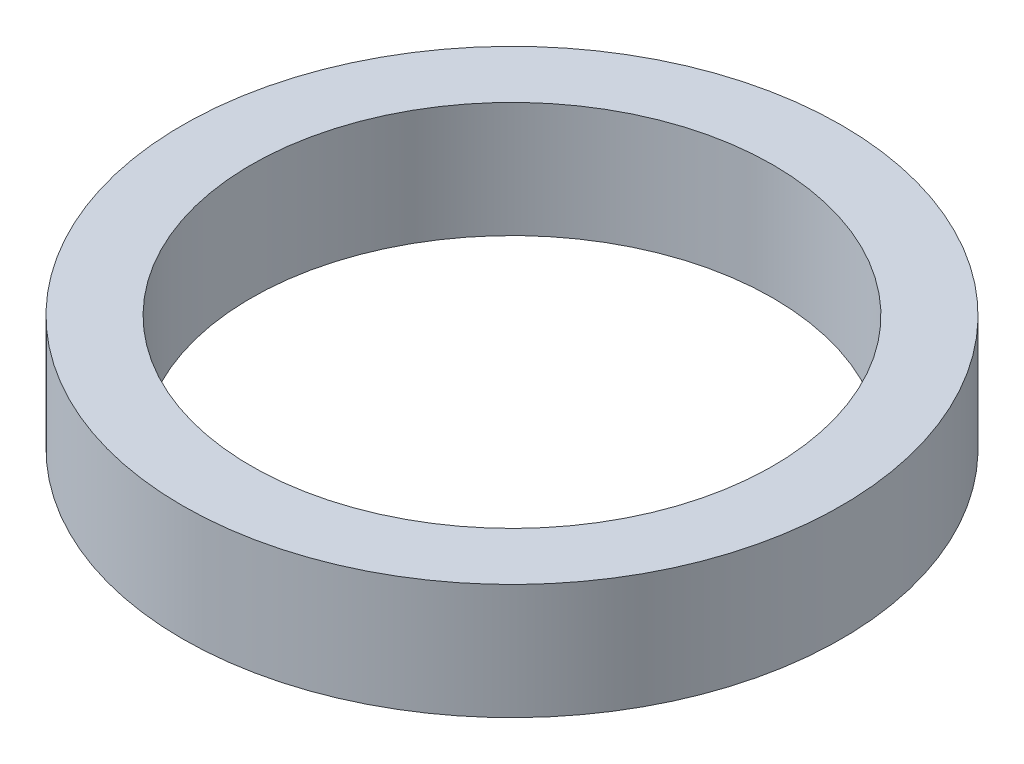
ISO-10303-21;
HEADER;
FILE_DESCRIPTION(('STEP AP214'),'2;1');
FILE_NAME('part.step','',(''),(''),'','','');
FILE_SCHEMA(('AUTOMOTIVE_DESIGN { 1 0 10303 214 1 1 1 1 }'));
ENDSEC;
DATA;
#1=APPLICATION_CONTEXT('core data for automotive mechanical design processes');
#2=APPLICATION_PROTOCOL_DEFINITION('international standard','automotive_design',2000,#1);
#3=PRODUCT_CONTEXT('',#1,'mechanical');
#4=PRODUCT('Part','Part','',(#3));
#5=PRODUCT_RELATED_PRODUCT_CATEGORY('part','',(#4));
#6=PRODUCT_DEFINITION_FORMATION('','',#4);
#7=PRODUCT_DEFINITION_CONTEXT('part definition',#1,'design');
#8=PRODUCT_DEFINITION('design','',#6,#7);
#9=PRODUCT_DEFINITION_SHAPE('','',#8);
#10=(LENGTH_UNIT() NAMED_UNIT(*) SI_UNIT(.MILLI.,.METRE.));
#11=(NAMED_UNIT(*) PLANE_ANGLE_UNIT() SI_UNIT($,.RADIAN.));
#12=(NAMED_UNIT(*) SI_UNIT($,.STERADIAN.) SOLID_ANGLE_UNIT());
#13=UNCERTAINTY_MEASURE_WITH_UNIT(LENGTH_MEASURE(1.E-05),#10,'distance_accuracy_value','');
#14=(GEOMETRIC_REPRESENTATION_CONTEXT(3) GLOBAL_UNCERTAINTY_ASSIGNED_CONTEXT((#13)) GLOBAL_UNIT_ASSIGNED_CONTEXT((#10,
#11,#12)) REPRESENTATION_CONTEXT('',''));
#15=CARTESIAN_POINT('',(0.,0.,0.));
#16=DIRECTION('',(0.,0.,1.));
#17=DIRECTION('',(1.,0.,0.));
#18=AXIS2_PLACEMENT_3D('',#15,#16,#17);
#19=CARTESIAN_POINT('',(0.,21.,0.));
#20=DIRECTION('',(0.,-1.,0.));
#21=DIRECTION('',(0.,0.,-1.));
#22=AXIS2_PLACEMENT_3D('',#19,#20,#21);
#23=CYLINDRICAL_SURFACE('',#22,60.);
#24=CARTESIAN_POINT('',(0.,21.,0.));
#25=DIRECTION('',(0.,1.,0.));
#26=DIRECTION('',(0.,0.,1.));
#27=AXIS2_PLACEMENT_3D('',#24,#25,#26);
#28=CIRCLE('',#27,60.);
#29=CARTESIAN_POINT('',(0.,21.,-60.));
#30=VERTEX_POINT('',#29);
#31=EDGE_CURVE('E10',#30,#30,#28,.T.);
#32=CARTESIAN_POINT('',(0.,0.,0.));
#33=DIRECTION('',(0.,1.,0.));
#34=DIRECTION('',(0.,0.,1.));
#35=AXIS2_PLACEMENT_3D('',#32,#33,#34);
#36=CIRCLE('',#35,60.);
#37=CARTESIAN_POINT('',(0.,0.,-60.));
#38=VERTEX_POINT('',#37);
#39=EDGE_CURVE('E37',#38,#38,#36,.T.);
#40=CARTESIAN_POINT('',(0.,21.,-60.));
#41=CARTESIAN_POINT('',(0.,20.78125,-60.));
#42=CARTESIAN_POINT('',(0.,20.5625,-60.));
#43=CARTESIAN_POINT('',(0.,20.125,-60.));
#44=CARTESIAN_POINT('',(0.,19.90625,-60.));
#45=CARTESIAN_POINT('',(0.,19.46875,-60.));
#46=CARTESIAN_POINT('',(0.,19.25,-60.));
#47=CARTESIAN_POINT('',(0.,18.8125,-60.));
#48=CARTESIAN_POINT('',(0.,18.59375,-60.));
#49=CARTESIAN_POINT('',(0.,18.15625,-60.));
#50=CARTESIAN_POINT('',(0.,17.9375,-60.));
#51=CARTESIAN_POINT('',(0.,17.5,-60.));
#52=CARTESIAN_POINT('',(0.,17.28125,-60.));
#53=CARTESIAN_POINT('',(0.,16.84375,-60.));
#54=CARTESIAN_POINT('',(0.,16.625,-60.));
#55=CARTESIAN_POINT('',(0.,16.1875,-60.));
#56=CARTESIAN_POINT('',(0.,15.96875,-60.));
#57=CARTESIAN_POINT('',(0.,15.53125,-60.));
#58=CARTESIAN_POINT('',(0.,15.3125,-60.));
#59=CARTESIAN_POINT('',(0.,14.875,-60.));
#60=CARTESIAN_POINT('',(0.,14.65625,-60.));
#61=CARTESIAN_POINT('',(0.,14.21875,-60.));
#62=CARTESIAN_POINT('',(0.,14.,-60.));
#63=CARTESIAN_POINT('',(0.,13.5625,-60.));
#64=CARTESIAN_POINT('',(0.,13.34375,-60.));
#65=CARTESIAN_POINT('',(0.,12.90625,-60.));
#66=CARTESIAN_POINT('',(0.,12.6875,-60.));
#67=CARTESIAN_POINT('',(0.,12.25,-60.));
#68=CARTESIAN_POINT('',(0.,12.03125,-60.));
#69=CARTESIAN_POINT('',(0.,11.59375,-60.));
#70=CARTESIAN_POINT('',(0.,11.375,-60.));
#71=CARTESIAN_POINT('',(0.,10.9375,-60.));
#72=CARTESIAN_POINT('',(0.,10.71875,-60.));
#73=CARTESIAN_POINT('',(0.,10.28125,-60.));
#74=CARTESIAN_POINT('',(0.,10.0625,-60.));
#75=CARTESIAN_POINT('',(0.,9.625,-60.));
#76=CARTESIAN_POINT('',(0.,9.40625,-60.));
#77=CARTESIAN_POINT('',(0.,8.96875,-60.));
#78=CARTESIAN_POINT('',(0.,8.75,-60.));
#79=CARTESIAN_POINT('',(0.,8.3125,-60.));
#80=CARTESIAN_POINT('',(0.,8.09375,-60.));
#81=CARTESIAN_POINT('',(0.,7.65625,-60.));
#82=CARTESIAN_POINT('',(0.,7.4375,-60.));
#83=CARTESIAN_POINT('',(0.,7.,-60.));
#84=CARTESIAN_POINT('',(0.,6.78125,-60.));
#85=CARTESIAN_POINT('',(0.,6.34375,-60.));
#86=CARTESIAN_POINT('',(0.,6.125,-60.));
#87=CARTESIAN_POINT('',(0.,5.6875,-60.));
#88=CARTESIAN_POINT('',(0.,5.46875,-60.));
#89=CARTESIAN_POINT('',(0.,5.03125,-60.));
#90=CARTESIAN_POINT('',(0.,4.8125,-60.));
#91=CARTESIAN_POINT('',(0.,4.375,-60.));
#92=CARTESIAN_POINT('',(0.,4.15625,-60.));
#93=CARTESIAN_POINT('',(0.,3.71875,-60.));
#94=CARTESIAN_POINT('',(0.,3.5,-60.));
#95=CARTESIAN_POINT('',(0.,3.0625,-60.));
#96=CARTESIAN_POINT('',(0.,2.84375,-60.));
#97=CARTESIAN_POINT('',(0.,2.40625,-60.));
#98=CARTESIAN_POINT('',(0.,2.1875,-60.));
#99=CARTESIAN_POINT('',(0.,1.75,-60.));
#100=CARTESIAN_POINT('',(0.,1.53125,-60.));
#101=CARTESIAN_POINT('',(0.,1.09375,-60.));
#102=CARTESIAN_POINT('',(0.,0.875000000000001,-60.));
#103=CARTESIAN_POINT('',(0.,0.4375,-60.));
#104=CARTESIAN_POINT('',(0.,0.21875,-60.));
#105=CARTESIAN_POINT('',(0.,0.,-60.));
#106=B_SPLINE_CURVE_WITH_KNOTS('',3,(#40,#41,#42,#43,#44,#45,#46,#47,#48,#49,#50,#51,#52,#53,
#54,#55,#56,#57,#58,#59,#60,#61,#62,#63,#64,#65,#66,#67,#68,#69,#70,#71,#72,#73,#74,#75,#76,#77,
#78,#79,#80,#81,#82,#83,#84,#85,#86,#87,#88,#89,#90,#91,#92,#93,#94,#95,#96,#97,#98,#99,#100,
#101,#102,#103,#104,#105),.UNSPECIFIED.,.F.,.F.,(4,2,2,2,2,2,2,2,2,2,2,2,2,2,2,2,2,2,2,2,2,2,2,
2,2,2,2,2,2,2,2,2,4),(0.,0.656250000000001,1.3125,1.96875,2.625,3.28125,3.9375,4.59375,5.25,
5.90625,6.5625,7.21875,7.875,8.53125,9.1875,9.84375,10.5,11.15625,11.8125,12.46875,13.125,
13.78125,14.4375,15.09375,15.75,16.40625,17.0625,17.71875,18.375,19.03125,19.6875,20.34375,21.),.UNSPECIFIED.);
#107=EDGE_CURVE('BSEAM40',#30,#38,#106,.T.);
#108=ORIENTED_EDGE('',*,*,#31,.F.);
#109=ORIENTED_EDGE('',*,*,#39,.T.);
#110=ORIENTED_EDGE('',*,*,#107,.T.);
#111=ORIENTED_EDGE('',*,*,#107,.F.);
#112=EDGE_LOOP('',(#108,#110,#109,#111));
#113=FACE_BOUND('',#112,.T.);
#114=ADVANCED_FACE('F40',(#113),#23,.T.);
#115=CARTESIAN_POINT('',(0.,21.,0.));
#116=DIRECTION('',(0.,1.,0.));
#117=DIRECTION('',(0.,0.,1.));
#118=AXIS2_PLACEMENT_3D('',#115,#116,#117);
#119=PLANE('',#118);
#120=CARTESIAN_POINT('',(0.,21.,0.));
#121=DIRECTION('',(0.,1.,0.));
#122=DIRECTION('',(0.,0.,1.));
#123=AXIS2_PLACEMENT_3D('',#120,#121,#122);
#124=CIRCLE('',#123,47.5);
#125=CARTESIAN_POINT('',(0.,21.,-47.5));
#126=VERTEX_POINT('',#125);
#127=EDGE_CURVE('E50',#126,#126,#124,.T.);
#128=ORIENTED_EDGE('',*,*,#127,.F.);
#129=EDGE_LOOP('',(#128));
#130=FACE_BOUND('',#129,.T.);
#131=ORIENTED_EDGE('',*,*,#31,.T.);
#132=EDGE_LOOP('',(#131));
#133=FACE_BOUND('',#132,.T.);
#134=ADVANCED_FACE('F59',(#130,#133),#119,.T.);
#135=CARTESIAN_POINT('',(0.,0.,0.));
#136=DIRECTION('',(0.,1.,0.));
#137=DIRECTION('',(0.,0.,1.));
#138=AXIS2_PLACEMENT_3D('',#135,#136,#137);
#139=PLANE('',#138);
#140=CARTESIAN_POINT('',(0.,0.,0.));
#141=DIRECTION('',(0.,1.,0.));
#142=DIRECTION('',(0.,0.,1.));
#143=AXIS2_PLACEMENT_3D('',#140,#141,#142);
#144=CIRCLE('',#143,47.5);
#145=CARTESIAN_POINT('',(0.,0.,-47.5));
#146=VERTEX_POINT('',#145);
#147=EDGE_CURVE('E47',#146,#146,#144,.T.);
#148=ORIENTED_EDGE('',*,*,#147,.T.);
#149=EDGE_LOOP('',(#148));
#150=FACE_BOUND('',#149,.T.);
#151=ORIENTED_EDGE('',*,*,#39,.F.);
#152=EDGE_LOOP('',(#151));
#153=FACE_BOUND('',#152,.T.);
#154=ADVANCED_FACE('F58',(#150,#153),#139,.F.);
#155=CARTESIAN_POINT('',(0.,21.,0.));
#156=DIRECTION('',(0.,-1.,0.));
#157=DIRECTION('',(0.,0.,-1.));
#158=AXIS2_PLACEMENT_3D('',#155,#156,#157);
#159=CYLINDRICAL_SURFACE('',#158,47.5);
#160=CARTESIAN_POINT('',(0.,21.,-47.5));
#161=CARTESIAN_POINT('',(0.,20.78125,-47.5));
#162=CARTESIAN_POINT('',(0.,20.5625,-47.5));
#163=CARTESIAN_POINT('',(0.,20.125,-47.5));
#164=CARTESIAN_POINT('',(0.,19.90625,-47.5));
#165=CARTESIAN_POINT('',(0.,19.46875,-47.5));
#166=CARTESIAN_POINT('',(0.,19.25,-47.5));
#167=CARTESIAN_POINT('',(0.,18.8125,-47.5));
#168=CARTESIAN_POINT('',(0.,18.59375,-47.5));
#169=CARTESIAN_POINT('',(0.,18.15625,-47.5));
#170=CARTESIAN_POINT('',(0.,17.9375,-47.5));
#171=CARTESIAN_POINT('',(0.,17.5,-47.5));
#172=CARTESIAN_POINT('',(0.,17.28125,-47.5));
#173=CARTESIAN_POINT('',(0.,16.84375,-47.5));
#174=CARTESIAN_POINT('',(0.,16.625,-47.5));
#175=CARTESIAN_POINT('',(0.,16.1875,-47.5));
#176=CARTESIAN_POINT('',(0.,15.96875,-47.5));
#177=CARTESIAN_POINT('',(0.,15.53125,-47.5));
#178=CARTESIAN_POINT('',(0.,15.3125,-47.5));
#179=CARTESIAN_POINT('',(0.,14.875,-47.5));
#180=CARTESIAN_POINT('',(0.,14.65625,-47.5));
#181=CARTESIAN_POINT('',(0.,14.21875,-47.5));
#182=CARTESIAN_POINT('',(0.,14.,-47.5));
#183=CARTESIAN_POINT('',(0.,13.5625,-47.5));
#184=CARTESIAN_POINT('',(0.,13.34375,-47.5));
#185=CARTESIAN_POINT('',(0.,12.90625,-47.5));
#186=CARTESIAN_POINT('',(0.,12.6875,-47.5));
#187=CARTESIAN_POINT('',(0.,12.25,-47.5));
#188=CARTESIAN_POINT('',(0.,12.03125,-47.5));
#189=CARTESIAN_POINT('',(0.,11.59375,-47.5));
#190=CARTESIAN_POINT('',(0.,11.375,-47.5));
#191=CARTESIAN_POINT('',(0.,10.9375,-47.5));
#192=CARTESIAN_POINT('',(0.,10.71875,-47.5));
#193=CARTESIAN_POINT('',(0.,10.28125,-47.5));
#194=CARTESIAN_POINT('',(0.,10.0625,-47.5));
#195=CARTESIAN_POINT('',(0.,9.625,-47.5));
#196=CARTESIAN_POINT('',(0.,9.40625,-47.5));
#197=CARTESIAN_POINT('',(0.,8.96875,-47.5));
#198=CARTESIAN_POINT('',(0.,8.75,-47.5));
#199=CARTESIAN_POINT('',(0.,8.3125,-47.5));
#200=CARTESIAN_POINT('',(0.,8.09375,-47.5));
#201=CARTESIAN_POINT('',(0.,7.65625,-47.5));
#202=CARTESIAN_POINT('',(0.,7.4375,-47.5));
#203=CARTESIAN_POINT('',(0.,7.,-47.5));
#204=CARTESIAN_POINT('',(0.,6.78125,-47.5));
#205=CARTESIAN_POINT('',(0.,6.34375,-47.5));
#206=CARTESIAN_POINT('',(0.,6.125,-47.5));
#207=CARTESIAN_POINT('',(0.,5.6875,-47.5));
#208=CARTESIAN_POINT('',(0.,5.46875,-47.5));
#209=CARTESIAN_POINT('',(0.,5.03125,-47.5));
#210=CARTESIAN_POINT('',(0.,4.8125,-47.5));
#211=CARTESIAN_POINT('',(0.,4.375,-47.5));
#212=CARTESIAN_POINT('',(0.,4.15625,-47.5));
#213=CARTESIAN_POINT('',(0.,3.71875,-47.5));
#214=CARTESIAN_POINT('',(0.,3.5,-47.5));
#215=CARTESIAN_POINT('',(0.,3.0625,-47.5));
#216=CARTESIAN_POINT('',(0.,2.84375,-47.5));
#217=CARTESIAN_POINT('',(0.,2.40625,-47.5));
#218=CARTESIAN_POINT('',(0.,2.1875,-47.5));
#219=CARTESIAN_POINT('',(0.,1.75,-47.5));
#220=CARTESIAN_POINT('',(0.,1.53125,-47.5));
#221=CARTESIAN_POINT('',(0.,1.09375,-47.5));
#222=CARTESIAN_POINT('',(0.,0.875000000000001,-47.5));
#223=CARTESIAN_POINT('',(0.,0.4375,-47.5));
#224=CARTESIAN_POINT('',(0.,0.21875,-47.5));
#225=CARTESIAN_POINT('',(0.,0.,-47.5));
#226=B_SPLINE_CURVE_WITH_KNOTS('',3,(#160,#161,#162,#163,#164,#165,#166,#167,#168,#169,#170,
#171,#172,#173,#174,#175,#176,#177,#178,#179,#180,#181,#182,#183,#184,#185,#186,#187,#188,#189,
#190,#191,#192,#193,#194,#195,#196,#197,#198,#199,#200,#201,#202,#203,#204,#205,#206,#207,#208,
#209,#210,#211,#212,#213,#214,#215,#216,#217,#218,#219,#220,#221,#222,#223,#224,#225),
.UNSPECIFIED.,.F.,.F.,(4,2,2,2,2,2,2,2,2,2,2,2,2,2,2,2,2,2,2,2,2,2,2,2,2,2,2,2,2,2,2,2,4),(0.,
0.656249999999997,1.3125,1.96875,2.625,3.28125,3.9375,4.59375,5.25,5.90625,6.5625,7.21875,7.875,
8.53125,9.1875,9.84375,10.5,11.15625,11.8125,12.46875,13.125,13.78125,14.4375,15.09375,15.75,
16.40625,17.0625,17.71875,18.375,19.03125,19.6875,20.34375,21.),.UNSPECIFIED.);
#227=EDGE_CURVE('BSEAM54',#126,#146,#226,.T.);
#228=ORIENTED_EDGE('',*,*,#127,.T.);
#229=ORIENTED_EDGE('',*,*,#147,.F.);
#230=ORIENTED_EDGE('',*,*,#227,.T.);
#231=ORIENTED_EDGE('',*,*,#227,.F.);
#232=EDGE_LOOP('',(#228,#230,#229,#231));
#233=FACE_BOUND('',#232,.T.);
#234=ADVANCED_FACE('F54',(#233),#159,.F.);
#235=CLOSED_SHELL('',(#114,#134,#154,#234));
#236=MANIFOLD_SOLID_BREP('B2',#235);
#237=ADVANCED_BREP_SHAPE_REPRESENTATION('',(#18,#236),#14);
#238=SHAPE_DEFINITION_REPRESENTATION(#9,#237);
ENDSEC;
END-ISO-10303-21;
